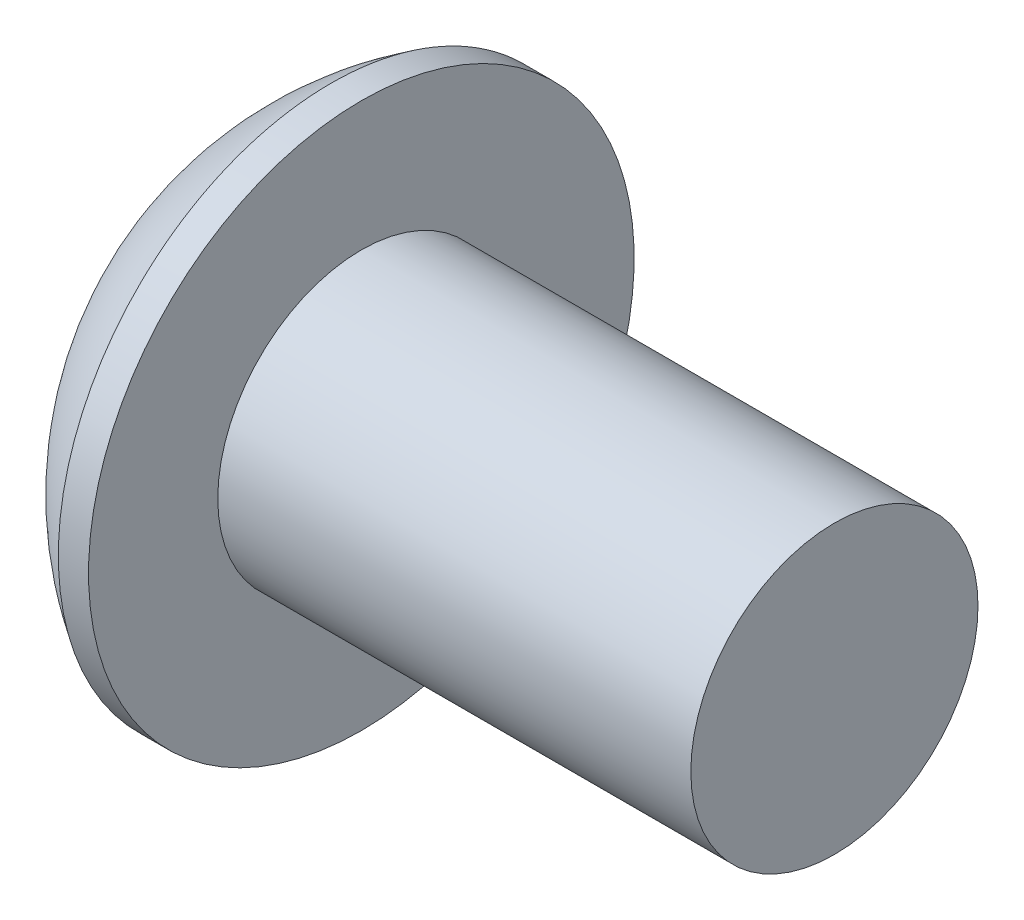
ISO-10303-21;
HEADER;
FILE_DESCRIPTION(('STEP AP214'),'2;1');
FILE_NAME('part.step','',(''),(''),'','','');
FILE_SCHEMA(('AUTOMOTIVE_DESIGN { 1 0 10303 214 1 1 1 1 }'));
ENDSEC;
DATA;
#1=APPLICATION_CONTEXT('core data for automotive mechanical design processes');
#2=APPLICATION_PROTOCOL_DEFINITION('international standard','automotive_design',2000,#1);
#3=PRODUCT_CONTEXT('',#1,'mechanical');
#4=PRODUCT('Part','Part','',(#3));
#5=PRODUCT_RELATED_PRODUCT_CATEGORY('part','',(#4));
#6=PRODUCT_DEFINITION_FORMATION('','',#4);
#7=PRODUCT_DEFINITION_CONTEXT('part definition',#1,'design');
#8=PRODUCT_DEFINITION('design','',#6,#7);
#9=PRODUCT_DEFINITION_SHAPE('','',#8);
#10=(LENGTH_UNIT() NAMED_UNIT(*) SI_UNIT(.MILLI.,.METRE.));
#11=(NAMED_UNIT(*) PLANE_ANGLE_UNIT() SI_UNIT($,.RADIAN.));
#12=(NAMED_UNIT(*) SI_UNIT($,.STERADIAN.) SOLID_ANGLE_UNIT());
#13=UNCERTAINTY_MEASURE_WITH_UNIT(LENGTH_MEASURE(1.E-05),#10,'distance_accuracy_value','');
#14=(GEOMETRIC_REPRESENTATION_CONTEXT(3) GLOBAL_UNCERTAINTY_ASSIGNED_CONTEXT((#13)) GLOBAL_UNIT_ASSIGNED_CONTEXT((#10,
#11,#12)) REPRESENTATION_CONTEXT('',''));
#15=CARTESIAN_POINT('',(0.,0.,0.));
#16=DIRECTION('',(0.,0.,1.));
#17=DIRECTION('',(1.,0.,0.));
#18=AXIS2_PLACEMENT_3D('',#15,#16,#17);
#19=CARTESIAN_POINT('',(-0.533400000000002,0.,0.));
#20=DIRECTION('',(-1.,0.,0.));
#21=DIRECTION('',(0.,0.,1.));
#22=AXIS2_PLACEMENT_3D('',#19,#20,#21);
#23=PLANE('',#22);
#24=DIRECTION('',(0.,0.5,0.866025403784439));
#25=VECTOR('',#24,1.);
#26=CARTESIAN_POINT('',(-0.533400000000002,1.83308710467706,0.));
#27=LINE('',#26,#25);
#28=CARTESIAN_POINT('',(-0.533400000000002,1.83308710467706,0.));
#29=VERTEX_POINT('',#28);
#30=CARTESIAN_POINT('',(-0.533400000000002,0.916543552338531,-1.5875));
#31=VERTEX_POINT('',#30);
#32=EDGE_CURVE('E114',#29,#31,#27,.F.);
#33=ORIENTED_EDGE('',*,*,#32,.T.);
#34=DIRECTION('',(0.,1.,0.));
#35=VECTOR('',#34,1.);
#36=CARTESIAN_POINT('',(-0.533400000000002,0.916543552338531,-1.5875));
#37=LINE('',#36,#35);
#38=CARTESIAN_POINT('',(-0.533400000000002,-0.916543552338531,-1.5875));
#39=VERTEX_POINT('',#38);
#40=EDGE_CURVE('E81',#31,#39,#37,.F.);
#41=ORIENTED_EDGE('',*,*,#40,.T.);
#42=DIRECTION('',(0.,0.5,-0.866025403784439));
#43=VECTOR('',#42,1.);
#44=CARTESIAN_POINT('',(-0.533400000000002,-0.916543552338531,-1.5875));
#45=LINE('',#44,#43);
#46=CARTESIAN_POINT('',(-0.533400000000002,-1.83308710467706,0.));
#47=VERTEX_POINT('',#46);
#48=EDGE_CURVE('E83',#39,#47,#45,.F.);
#49=ORIENTED_EDGE('',*,*,#48,.T.);
#50=DIRECTION('',(0.,-0.5,-0.866025403784439));
#51=VECTOR('',#50,1.);
#52=CARTESIAN_POINT('',(-0.533400000000002,-1.83308710467706,0.));
#53=LINE('',#52,#51);
#54=CARTESIAN_POINT('',(-0.533400000000002,-0.916543552338533,1.5875));
#55=VERTEX_POINT('',#54);
#56=EDGE_CURVE('E84',#47,#55,#53,.F.);
#57=ORIENTED_EDGE('',*,*,#56,.T.);
#58=DIRECTION('',(0.,-1.,0.));
#59=VECTOR('',#58,1.);
#60=CARTESIAN_POINT('',(-0.533400000000002,-0.916543552338532,1.5875));
#61=LINE('',#60,#59);
#62=CARTESIAN_POINT('',(-0.533400000000002,0.916543552338531,1.5875));
#63=VERTEX_POINT('',#62);
#64=EDGE_CURVE('E70',#55,#63,#61,.F.);
#65=ORIENTED_EDGE('',*,*,#64,.T.);
#66=DIRECTION('',(0.,-0.5,0.866025403784439));
#67=VECTOR('',#66,1.);
#68=CARTESIAN_POINT('',(-0.533400000000002,0.916543552338531,1.5875));
#69=LINE('',#68,#67);
#70=EDGE_CURVE('E109',#63,#29,#69,.F.);
#71=ORIENTED_EDGE('',*,*,#70,.T.);
#72=EDGE_LOOP('',(#33,#41,#49,#57,#65,#71));
#73=FACE_BOUND('',#72,.T.);
#74=ADVANCED_FACE('F16',(#73),#23,.T.);
#75=CARTESIAN_POINT('',(-0.533400000000002,-1.83308710467706,0.));
#76=DIRECTION('',(0.,-0.866025403784439,0.5));
#77=DIRECTION('',(0.,-0.5,-0.866025403784439));
#78=AXIS2_PLACEMENT_3D('',#75,#76,#77);
#79=PLANE('',#78);
#80=CARTESIAN_POINT('',(-2.56539999994394,-1.8330871046745,-2.00804498786736E-11));
#81=CARTESIAN_POINT('',(-2.53392818229741,-1.80158505518366,0.0545631502562923));
#82=CARTESIAN_POINT('',(-2.5043050627177,-1.76955629074211,0.110038597579172));
#83=CARTESIAN_POINT('',(-2.45006639539122,-1.70424635317817,0.223158727683824));
#84=CARTESIAN_POINT('',(-2.42548101615987,-1.6709589724711,0.280814162317604));
#85=CARTESIAN_POINT('',(-2.38336609605347,-1.60383660211837,0.397073518091736));
#86=CARTESIAN_POINT('',(-2.36573072948629,-1.57001869730198,0.455647847439699));
#87=CARTESIAN_POINT('',(-2.33856008862263,-1.50163859306838,0.574085662199493));
#88=CARTESIAN_POINT('',(-2.32900454007239,-1.46707848106388,0.633945532106421));
#89=CARTESIAN_POINT('',(-2.32038274183869,-1.40751253669323,0.737116774157155));
#90=CARTESIAN_POINT('',(-2.31910682172836,-1.38258360390154,0.780294952330845));
#91=CARTESIAN_POINT('',(-2.32125913780735,-1.33276652395073,0.866580665890379));
#92=CARTESIAN_POINT('',(-2.32468902284537,-1.30787839414808,0.90968817121394));
#93=CARTESIAN_POINT('',(-2.33605631415915,-1.25834345643267,0.995485200086784));
#94=CARTESIAN_POINT('',(-2.34399762019329,-1.23369687609494,1.03817432946455));
#95=CARTESIAN_POINT('',(-2.36395627681902,-1.18481740842653,1.12283605091316));
#96=CARTESIAN_POINT('',(-2.37597537628367,-1.16058470328902,1.16480832741616));
#97=CARTESIAN_POINT('',(-2.41164383187845,-1.09853862948576,1.27227527965358));
#98=CARTESIAN_POINT('',(-2.43797770752625,-1.06110942924036,1.33710455616529));
#99=CARTESIAN_POINT('',(-2.48243061452926,-1.00607390269188,1.43242888436855));
#100=CARTESIAN_POINT('',(-2.49804835924321,-0.987937988038022,1.46384120999077));
#101=CARTESIAN_POINT('',(-2.53070945051393,-0.951999508520197,1.52608848246242));
#102=CARTESIAN_POINT('',(-2.54775211871235,-0.934196789917587,1.55692369559499));
#103=CARTESIAN_POINT('',(-2.56539999993807,-0.916543552329633,1.58750000001541));
#104=B_SPLINE_CURVE_WITH_KNOTS('',3,(#80,#81,#82,#83,#84,#85,#86,#87,#88,#89,#90,#91,#92,#93,
#94,#95,#96,#97,#98,#99,#100,#101,#102,#103),.UNSPECIFIED.,.F.,.F.,(4,2,2,2,2,2,2,2,2,2,2,4),
(0.,0.211427927732169,0.424087197148228,0.633370156422424,0.842126401515785,0.991537201098734,
1.14100036552056,1.29059292577265,1.44024972414947,1.67781721417335,1.79627069411587,
1.91466809995991),.UNSPECIFIED.);
#105=CARTESIAN_POINT('',(-2.56539999993857,-1.83308710468646,0.));
#106=VERTEX_POINT('',#105);
#107=CARTESIAN_POINT('',(-2.56539999993106,-0.916543552342318,1.5875));
#108=VERTEX_POINT('',#107);
#109=EDGE_CURVE('E19',#106,#108,#104,.T.);
#110=ORIENTED_EDGE('',*,*,#109,.T.);
#111=DIRECTION('',(1.,0.,0.));
#112=VECTOR('',#111,1.);
#113=CARTESIAN_POINT('',(-0.533400000000002,-0.916543552338533,1.5875));
#114=LINE('',#113,#112);
#115=EDGE_CURVE('E89',#108,#55,#114,.T.);
#116=ORIENTED_EDGE('',*,*,#115,.T.);
#117=ORIENTED_EDGE('',*,*,#56,.F.);
#118=DIRECTION('',(1.,0.,0.));
#119=VECTOR('',#118,1.);
#120=CARTESIAN_POINT('',(-0.533400000000002,-1.83308710467706,0.));
#121=LINE('',#120,#119);
#122=EDGE_CURVE('E57',#47,#106,#121,.F.);
#123=ORIENTED_EDGE('',*,*,#122,.T.);
#124=EDGE_LOOP('',(#110,#116,#117,#123));
#125=FACE_BOUND('',#124,.T.);
#126=ADVANCED_FACE('F88',(#125),#79,.F.);
#127=CARTESIAN_POINT('',(-0.533400000000002,-0.916543552338531,-1.5875));
#128=DIRECTION('',(0.,-0.866025403784439,-0.5));
#129=DIRECTION('',(0.,0.5,-0.866025403784439));
#130=AXIS2_PLACEMENT_3D('',#127,#128,#129);
#131=PLANE('',#130);
#132=CARTESIAN_POINT('',(-2.56539999994527,-0.916543552319403,-1.58750000001409));
#133=CARTESIAN_POINT('',(-2.53392818229919,-0.948045601822691,-1.53293684974403));
#134=CARTESIAN_POINT('',(-2.50430506271949,-0.980074366269487,-1.47746140242354));
#135=CARTESIAN_POINT('',(-2.45006639539264,-1.04538430383757,-1.36434127232016));
#136=CARTESIAN_POINT('',(-2.42548101616093,-1.07867168454351,-1.30668583768523));
#137=CARTESIAN_POINT('',(-2.38336609605398,-1.14579405489574,-1.19042648190974));
#138=CARTESIAN_POINT('',(-2.36573072948662,-1.17961195971273,-1.13185215256154));
#139=CARTESIAN_POINT('',(-2.3385600886227,-1.2479920639471,-1.013414337801));
#140=CARTESIAN_POINT('',(-2.32900454007237,-1.28255217595175,-0.953554467893575));
#141=CARTESIAN_POINT('',(-2.32038274183866,-1.34211812032265,-0.850383225842316));
#142=CARTESIAN_POINT('',(-2.31910682172835,-1.36704705311438,-0.807205047668587));
#143=CARTESIAN_POINT('',(-2.32125913780739,-1.41686413306525,-0.720919334108961));
#144=CARTESIAN_POINT('',(-2.32468902284544,-1.44175226286793,-0.67781182878535));
#145=CARTESIAN_POINT('',(-2.33605631415929,-1.49128720058339,-0.592014799912417));
#146=CARTESIAN_POINT('',(-2.34399762019345,-1.51593378092113,-0.54932567053461));
#147=CARTESIAN_POINT('',(-2.36395627681926,-1.56481324858959,-0.464663949085931));
#148=CARTESIAN_POINT('',(-2.37597537628395,-1.58904595372712,-0.422691672582891));
#149=CARTESIAN_POINT('',(-2.41164383187876,-1.65109202753029,-0.315224720345625));
#150=CARTESIAN_POINT('',(-2.43797770752652,-1.6885212277756,-0.250395443834082));
#151=CARTESIAN_POINT('',(-2.48243061452944,-1.74355675432393,-0.15507111563107));
#152=CARTESIAN_POINT('',(-2.49804835924337,-1.76169266897775,-0.123658790008927));
#153=CARTESIAN_POINT('',(-2.53070945051401,-1.79763114849548,-0.0614115175374324));
#154=CARTESIAN_POINT('',(-2.5477521187124,-1.81543386709805,-0.0305763044049344));
#155=CARTESIAN_POINT('',(-2.56539999993807,-1.83308710468596,1.54136844652939E-11));
#156=B_SPLINE_CURVE_WITH_KNOTS('',3,(#132,#133,#134,#135,#136,#137,#138,#139,#140,#141,#142,
#143,#144,#145,#146,#147,#148,#149,#150,#151,#152,#153,#154,#155),.UNSPECIFIED.,.F.,.F.,(4,2,2,
2,2,2,2,2,2,2,2,4),(0.,0.211427927733669,0.424087197151313,0.633370156427101,0.842126401522016,
0.99153720110513,1.14100036552713,1.29059292577937,1.44024972415633,1.67781721417961,
1.79627069412184,1.9146680999656),.UNSPECIFIED.);
#157=CARTESIAN_POINT('',(-2.56539999995198,-0.916543552351339,-1.58750000002218));
#158=VERTEX_POINT('',#157);
#159=EDGE_CURVE('E93',#158,#106,#156,.T.);
#160=ORIENTED_EDGE('',*,*,#159,.T.);
#161=ORIENTED_EDGE('',*,*,#122,.F.);
#162=ORIENTED_EDGE('',*,*,#48,.F.);
#163=DIRECTION('',(-1.,0.,0.));
#164=VECTOR('',#163,1.);
#165=CARTESIAN_POINT('',(-0.533400000000002,-0.916543552338531,-1.5875));
#166=LINE('',#165,#164);
#167=EDGE_CURVE('E95',#39,#158,#166,.T.);
#168=ORIENTED_EDGE('',*,*,#167,.T.);
#169=EDGE_LOOP('',(#160,#161,#162,#168));
#170=FACE_BOUND('',#169,.T.);
#171=ADVANCED_FACE('F91',(#170),#131,.F.);
#172=CARTESIAN_POINT('',(-0.533400000000002,0.916543552338531,-1.5875));
#173=DIRECTION('',(0.,0.,-1.));
#174=DIRECTION('',(-1.,0.,0.));
#175=AXIS2_PLACEMENT_3D('',#172,#173,#174);
#176=PLANE('',#175);
#177=CARTESIAN_POINT('',(-2.56539999994527,0.916543552360294,-1.58749999999048));
#178=CARTESIAN_POINT('',(-2.53392818229821,0.853539453376781,-1.58749999999657));
#179=CARTESIAN_POINT('',(-2.50430506271702,0.789481924500113,-1.58749999999908));
#180=CARTESIAN_POINT('',(-2.45006639538581,0.658862049392287,-1.58750000000093));
#181=CARTESIAN_POINT('',(-2.42548101615122,0.59228728799181,-1.58750000000025));
#182=CARTESIAN_POINT('',(-2.38336609603683,0.458042547310979,-1.58749999999976));
#183=CARTESIAN_POINT('',(-2.36573072946494,0.390406737689213,-1.58749999999994));
#184=CARTESIAN_POINT('',(-2.3385600885904,0.253646529243895,-1.58750000000006));
#185=CARTESIAN_POINT('',(-2.32900454003397,0.184526305245804,-1.58750000000001));
#186=CARTESIAN_POINT('',(-2.32038274178942,0.0653944165301613,-1.58749999999999));
#187=CARTESIAN_POINT('',(-2.31910682167392,0.0155365509618711,-1.5875));
#188=CARTESIAN_POINT('',(-2.3212591377409,-0.0840976089101244,-1.5875));
#189=CARTESIAN_POINT('',(-2.32468902277208,-0.133873868500894,-1.5875));
#190=CARTESIAN_POINT('',(-2.33605631407098,-0.2329437439033,-1.5875));
#191=CARTESIAN_POINT('',(-2.34399762009707,-0.282236904564879,-1.5875));
#192=CARTESIAN_POINT('',(-2.36395627670599,-0.379995839874564,-1.5875));
#193=CARTESIAN_POINT('',(-2.37597537616188,-0.428461250136325,-1.5875));
#194=CARTESIAN_POINT('',(-2.41164383175616,-0.552553397787632,-1.5875));
#195=CARTESIAN_POINT('',(-2.43797770742117,-0.627411798334259,-1.5875));
#196=CARTESIAN_POINT('',(-2.48243061445881,-0.737482851511091,-1.5875));
#197=CARTESIAN_POINT('',(-2.49804835918582,-0.773754680844889,-1.5875));
#198=CARTESIAN_POINT('',(-2.53070945048496,-0.845631639931401,-1.5875));
#199=CARTESIAN_POINT('',(-2.54775211869874,-0.881237077161412,-1.5875));
#200=CARTESIAN_POINT('',(-2.56539999994071,-0.916543552361606,-1.5875));
#201=B_SPLINE_CURVE_WITH_KNOTS('',3,(#177,#178,#179,#180,#181,#182,#183,#184,#185,#186,#187,
#188,#189,#190,#191,#192,#193,#194,#195,#196,#197,#198,#199,#200),.UNSPECIFIED.,.F.,.F.,(4,2,2,
2,2,2,2,2,2,2,2,4),(0.,0.211427927701375,0.424087197086717,0.633370156331471,0.842126401395377,
0.991537200933545,1.14100036531054,1.29059292551773,1.44024972384963,1.677817214047,
1.79627069407681,1.91466810000777),.UNSPECIFIED.);
#202=CARTESIAN_POINT('',(-2.56539999995198,0.916543552337129,-1.58749999999757));
#203=VERTEX_POINT('',#202);
#204=EDGE_CURVE('E197',#203,#158,#201,.T.);
#205=ORIENTED_EDGE('',*,*,#204,.T.);
#206=ORIENTED_EDGE('',*,*,#167,.F.);
#207=ORIENTED_EDGE('',*,*,#40,.F.);
#208=DIRECTION('',(1.,0.,0.));
#209=VECTOR('',#208,1.);
#210=CARTESIAN_POINT('',(-0.533400000000002,0.916543552338531,-1.5875));
#211=LINE('',#210,#209);
#212=EDGE_CURVE('E111',#31,#203,#211,.F.);
#213=ORIENTED_EDGE('',*,*,#212,.T.);
#214=EDGE_LOOP('',(#205,#206,#207,#213));
#215=FACE_BOUND('',#214,.T.);
#216=ADVANCED_FACE('F187',(#215),#176,.F.);
#217=CARTESIAN_POINT('',(-0.533400000000002,1.83308710467706,0.));
#218=DIRECTION('',(0.,0.866025403784439,-0.5));
#219=DIRECTION('',(0.,0.5,0.866025403784439));
#220=AXIS2_PLACEMENT_3D('',#217,#218,#219);
#221=PLANE('',#220);
#222=CARTESIAN_POINT('',(-2.56539999994394,1.8330871046745,2.00800374309997E-11));
#223=CARTESIAN_POINT('',(-2.5339281822974,1.80158505518366,-0.0545631502562965));
#224=CARTESIAN_POINT('',(-2.5043050627177,1.76955629074211,-0.11003859757918));
#225=CARTESIAN_POINT('',(-2.45006639539121,1.70424635317816,-0.22315872768384));
#226=CARTESIAN_POINT('',(-2.42548101615987,1.67095897247109,-0.280814162317626));
#227=CARTESIAN_POINT('',(-2.38336609605347,1.60383660211835,-0.397073518091758));
#228=CARTESIAN_POINT('',(-2.36573072948628,1.57001869730197,-0.455647847439717));
#229=CARTESIAN_POINT('',(-2.33856008862263,1.50163859306837,-0.574085662199503));
#230=CARTESIAN_POINT('',(-2.32900454007239,1.46707848106388,-0.633945532106426));
#231=CARTESIAN_POINT('',(-2.32038274183869,1.40751253669322,-0.737116774157154));
#232=CARTESIAN_POINT('',(-2.31910682172836,1.38258360390154,-0.780294952330843));
#233=CARTESIAN_POINT('',(-2.32125913780735,1.33276652395073,-0.866580665890374));
#234=CARTESIAN_POINT('',(-2.32468902284537,1.30787839414808,-0.909688171213933));
#235=CARTESIAN_POINT('',(-2.33605631415915,1.25834345643267,-0.995485200086777));
#236=CARTESIAN_POINT('',(-2.34399762019328,1.23369687609495,-1.03817432946455));
#237=CARTESIAN_POINT('',(-2.36395627681902,1.18481740842653,-1.12283605091316));
#238=CARTESIAN_POINT('',(-2.37597537628367,1.16058470328902,-1.16480832741616));
#239=CARTESIAN_POINT('',(-2.41164383187872,1.09853862948529,-1.2722752796544));
#240=CARTESIAN_POINT('',(-2.43797770752691,1.06110942923942,-1.33710455616691));
#241=CARTESIAN_POINT('',(-2.48243061453059,1.00607390269029,-1.43242888437131));
#242=CARTESIAN_POINT('',(-2.49804835924479,0.987937988036214,-1.4638412099939));
#243=CARTESIAN_POINT('',(-2.53070945051602,0.951999508517968,-1.52608848246628));
#244=CARTESIAN_POINT('',(-2.54775211871471,0.934196789915152,-1.55692369559921));
#245=CARTESIAN_POINT('',(-2.56539999994071,0.916543552326994,-1.58750000001998));
#246=B_SPLINE_CURVE_WITH_KNOTS('',3,(#222,#223,#224,#225,#226,#227,#228,#229,#230,#231,#232,
#233,#234,#235,#236,#237,#238,#239,#240,#241,#242,#243,#244,#245),.UNSPECIFIED.,.F.,.F.,(4,2,2,
2,2,2,2,2,2,2,2,4),(0.,0.211427927732185,0.424087197148259,0.63337015642244,0.842126401515786,
0.99153720109873,1.14100036552055,1.29059292577265,1.44024972414947,1.67781721417631,
1.7962706941203,1.9146680999658),.UNSPECIFIED.);
#247=CARTESIAN_POINT('',(-2.56539999993857,1.83308710468646,0.));
#248=VERTEX_POINT('',#247);
#249=EDGE_CURVE('E191',#248,#203,#246,.T.);
#250=ORIENTED_EDGE('',*,*,#249,.T.);
#251=ORIENTED_EDGE('',*,*,#212,.F.);
#252=ORIENTED_EDGE('',*,*,#32,.F.);
#253=DIRECTION('',(1.,0.,0.));
#254=VECTOR('',#253,1.);
#255=CARTESIAN_POINT('',(-0.533400000000002,1.83308710467706,0.));
#256=LINE('',#255,#254);
#257=EDGE_CURVE('E106',#29,#248,#256,.F.);
#258=ORIENTED_EDGE('',*,*,#257,.T.);
#259=EDGE_LOOP('',(#250,#251,#252,#258));
#260=FACE_BOUND('',#259,.T.);
#261=ADVANCED_FACE('F183',(#260),#221,.F.);
#262=CARTESIAN_POINT('',(-0.533400000000002,0.916543552338531,1.5875));
#263=DIRECTION('',(0.,0.866025403784439,0.5));
#264=DIRECTION('',(0.,-0.5,0.866025403784439));
#265=AXIS2_PLACEMENT_3D('',#262,#263,#264);
#266=PLANE('',#265);
#267=CARTESIAN_POINT('',(-2.56539999994394,0.91654355231986,1.58750000000782));
#268=CARTESIAN_POINT('',(-2.53392818229741,0.948045601824288,1.5329368497393));
#269=CARTESIAN_POINT('',(-2.5043050627177,0.980074366271431,1.47746140241964));
#270=CARTESIAN_POINT('',(-2.45006639539122,1.04538430383949,1.36434127231737));
#271=CARTESIAN_POINT('',(-2.42548101615987,1.07867168454504,1.30668583768271));
#272=CARTESIAN_POINT('',(-2.38336609605347,1.14579405489669,1.19042648190795));
#273=CARTESIAN_POINT('',(-2.36573072948629,1.17961195971347,1.13185215256022));
#274=CARTESIAN_POINT('',(-2.33856008862263,1.24799206394736,1.01341433780059));
#275=CARTESIAN_POINT('',(-2.32900454007239,1.28255217595174,0.953554467893597));
#276=CARTESIAN_POINT('',(-2.32038274183869,1.34211812032234,0.850383225842832));
#277=CARTESIAN_POINT('',(-2.31910682172836,1.36704705311405,0.807205047669152));
#278=CARTESIAN_POINT('',(-2.32125913780735,1.41686413306487,0.720919334109624));
#279=CARTESIAN_POINT('',(-2.32468902284537,1.44175226286752,0.677811828786061));
#280=CARTESIAN_POINT('',(-2.33605631415915,1.49128720058292,0.592014799913215));
#281=CARTESIAN_POINT('',(-2.34399762019328,1.51593378092065,0.549325670535446));
#282=CARTESIAN_POINT('',(-2.36395627681902,1.56481324858906,0.464663949086841));
#283=CARTESIAN_POINT('',(-2.37597537628367,1.58904595372657,0.422691672583837));
#284=CARTESIAN_POINT('',(-2.41164383187845,1.65109202752983,0.315224720346425));
#285=CARTESIAN_POINT('',(-2.43797770752625,1.68852122777524,0.250395443834706));
#286=CARTESIAN_POINT('',(-2.48243061452926,1.74355675432371,0.155071115631445));
#287=CARTESIAN_POINT('',(-2.49804835924321,1.76169266897757,0.123658790009225));
#288=CARTESIAN_POINT('',(-2.53070945051393,1.7976311484954,0.0614115175375789));
#289=CARTESIAN_POINT('',(-2.54775211871235,1.81543386709801,0.0305763044050067));
#290=CARTESIAN_POINT('',(-2.56539999993807,1.83308710468596,-1.54142580803093E-11));
#291=B_SPLINE_CURVE_WITH_KNOTS('',3,(#267,#268,#269,#270,#271,#272,#273,#274,#275,#276,#277,
#278,#279,#280,#281,#282,#283,#284,#285,#286,#287,#288,#289,#290),.UNSPECIFIED.,.F.,.F.,(4,2,2,
2,2,2,2,2,2,2,2,4),(0.,0.211427927732169,0.424087197148227,0.633370156422423,0.842126401515785,
0.991537201098733,1.14100036552056,1.29059292577265,1.44024972414946,1.67781721417335,
1.79627069411587,1.91466809995991),.UNSPECIFIED.);
#292=CARTESIAN_POINT('',(-2.56539999993857,0.91654355234323,1.58750000000814));
#293=VERTEX_POINT('',#292);
#294=EDGE_CURVE('E165',#293,#248,#291,.T.);
#295=ORIENTED_EDGE('',*,*,#294,.T.);
#296=ORIENTED_EDGE('',*,*,#257,.F.);
#297=ORIENTED_EDGE('',*,*,#70,.F.);
#298=DIRECTION('',(1.,0.,0.));
#299=VECTOR('',#298,1.);
#300=CARTESIAN_POINT('',(-0.533400000000002,0.916543552338531,1.5875));
#301=LINE('',#300,#299);
#302=EDGE_CURVE('E38',#63,#293,#301,.F.);
#303=ORIENTED_EDGE('',*,*,#302,.T.);
#304=EDGE_LOOP('',(#295,#296,#297,#303));
#305=FACE_BOUND('',#304,.T.);
#306=ADVANCED_FACE('F176',(#305),#266,.F.);
#307=CARTESIAN_POINT('',(-0.533400000000002,-0.916543552338532,1.5875));
#308=DIRECTION('',(0.,0.,1.));
#309=DIRECTION('',(0.,-1.,0.));
#310=AXIS2_PLACEMENT_3D('',#307,#308,#309);
#311=PLANE('',#310);
#312=CARTESIAN_POINT('',(-2.56539999994394,-0.916543552354642,1.58749999998774));
#313=CARTESIAN_POINT('',(-2.53392818229741,-0.853539453359365,1.58749999999559));
#314=CARTESIAN_POINT('',(-2.50430506271771,-0.789481924470656,1.58749999999882));
#315=CARTESIAN_POINT('',(-2.45006639539122,-0.658862049338629,1.58750000000119));
#316=CARTESIAN_POINT('',(-2.42548101615988,-0.592287287925995,1.58750000000032));
#317=CARTESIAN_POINT('',(-2.38336609605349,-0.458042547221593,1.58749999999969));
#318=CARTESIAN_POINT('',(-2.36573072948631,-0.390406737588416,1.58749999999992));
#319=CARTESIAN_POINT('',(-2.33856008862266,-0.253646529120892,1.58750000000008));
#320=CARTESIAN_POINT('',(-2.32900454007243,-0.184526305112002,1.58750000000002));
#321=CARTESIAN_POINT('',(-2.32038274183874,-0.065394416370719,1.58749999999999));
#322=CARTESIAN_POINT('',(-2.31910682172841,-0.0155365507873145,1.5875));
#323=CARTESIAN_POINT('',(-2.32125913780742,0.0840976091143436,1.5875));
#324=CARTESIAN_POINT('',(-2.32468902284545,0.133873868719661,1.5875));
#325=CARTESIAN_POINT('',(-2.33605631415924,0.232943744150505,1.5875));
#326=CARTESIAN_POINT('',(-2.34399762019338,0.282236904825971,1.5875));
#327=CARTESIAN_POINT('',(-2.36395627681913,0.379995840162817,1.5875));
#328=CARTESIAN_POINT('',(-2.37597537628379,0.428461250437852,1.5875));
#329=CARTESIAN_POINT('',(-2.41164383187857,0.552553398044325,1.5875));
#330=CARTESIAN_POINT('',(-2.43797770752636,0.627411798535089,1.5875));
#331=CARTESIAN_POINT('',(-2.48243061452933,0.737482851631955,1.5875));
#332=CARTESIAN_POINT('',(-2.49804835924327,0.773754680939651,1.5875));
#333=CARTESIAN_POINT('',(-2.53070945051396,0.84563163997525,1.5875));
#334=CARTESIAN_POINT('',(-2.54775211871237,0.881237077180446,1.5875));
#335=CARTESIAN_POINT('',(-2.56539999993807,0.91654355235633,1.5875));
#336=B_SPLINE_CURVE_WITH_KNOTS('',3,(#312,#313,#314,#315,#316,#317,#318,#319,#320,#321,#322,
#323,#324,#325,#326,#327,#328,#329,#330,#331,#332,#333,#334,#335),.UNSPECIFIED.,.F.,.F.,(4,2,2,
2,2,2,2,2,2,2,2,4),(0.,0.211427927732202,0.424087197148294,0.633370156422521,0.842126401515914,
0.991537201098908,1.14100036552078,1.29059292577292,1.44024972414978,1.67781721417349,
1.79627069411592,1.91466809995988),.UNSPECIFIED.);
#337=EDGE_CURVE('E157',#108,#293,#336,.T.);
#338=ORIENTED_EDGE('',*,*,#337,.T.);
#339=ORIENTED_EDGE('',*,*,#302,.F.);
#340=ORIENTED_EDGE('',*,*,#64,.F.);
#341=ORIENTED_EDGE('',*,*,#115,.F.);
#342=EDGE_LOOP('',(#338,#339,#340,#341));
#343=FACE_BOUND('',#342,.T.);
#344=ADVANCED_FACE('F172',(#343),#311,.F.);
#345=CARTESIAN_POINT('',(-2.56540000003724,0.,0.));
#346=DIRECTION('',(-1.,0.,0.));
#347=DIRECTION('',(0.,-1.,0.));
#348=AXIS2_PLACEMENT_3D('',#345,#346,#347);
#349=CONICAL_SURFACE('',#348,1.83308710478514,0.78539816351237);
#350=ORIENTED_EDGE('',*,*,#109,.F.);
#351=CARTESIAN_POINT('',(-2.56539999992356,0.,0.));
#352=DIRECTION('',(-1.,0.,0.));
#353=DIRECTION('',(0.,-1.,0.));
#354=AXIS2_PLACEMENT_3D('',#351,#352,#353);
#355=CIRCLE('',#354,1.83308710467145);
#356=EDGE_CURVE('E164',#108,#106,#355,.F.);
#357=ORIENTED_EDGE('',*,*,#356,.F.);
#358=EDGE_LOOP('',(#350,#357));
#359=FACE_BOUND('',#358,.T.);
#360=ADVANCED_FACE('F175',(#359),#349,.F.);
#361=CARTESIAN_POINT('',(-2.56540000003724,0.,0.));
#362=DIRECTION('',(-1.,0.,0.));
#363=DIRECTION('',(0.,-1.,0.));
#364=AXIS2_PLACEMENT_3D('',#361,#362,#363);
#365=CONICAL_SURFACE('',#364,1.83308710478514,0.78539816351237);
#366=ORIENTED_EDGE('',*,*,#159,.F.);
#367=CARTESIAN_POINT('',(-2.56539999992356,0.,0.));
#368=DIRECTION('',(-1.,0.,0.));
#369=DIRECTION('',(0.,-1.,0.));
#370=AXIS2_PLACEMENT_3D('',#367,#368,#369);
#371=CIRCLE('',#370,1.83308710467145);
#372=EDGE_CURVE('E272',#106,#158,#371,.F.);
#373=ORIENTED_EDGE('',*,*,#372,.F.);
#374=EDGE_LOOP('',(#366,#373));
#375=FACE_BOUND('',#374,.T.);
#376=ADVANCED_FACE('F209',(#375),#365,.F.);
#377=CARTESIAN_POINT('',(-2.56540000003724,0.,0.));
#378=DIRECTION('',(-1.,0.,0.));
#379=DIRECTION('',(0.,-1.,0.));
#380=AXIS2_PLACEMENT_3D('',#377,#378,#379);
#381=CONICAL_SURFACE('',#380,1.83308710478514,0.785398163397448);
#382=ORIENTED_EDGE('',*,*,#204,.F.);
#383=CARTESIAN_POINT('',(-2.5653999999804,0.,0.));
#384=DIRECTION('',(-1.,0.,0.));
#385=DIRECTION('',(0.,-1.,0.));
#386=AXIS2_PLACEMENT_3D('',#383,#384,#385);
#387=CIRCLE('',#386,1.83308710472829);
#388=EDGE_CURVE('E269',#158,#203,#387,.F.);
#389=ORIENTED_EDGE('',*,*,#388,.F.);
#390=EDGE_LOOP('',(#382,#389));
#391=FACE_BOUND('',#390,.T.);
#392=ADVANCED_FACE('F205',(#391),#381,.F.);
#393=CARTESIAN_POINT('',(-2.56540000003724,0.,0.));
#394=DIRECTION('',(-1.,0.,0.));
#395=DIRECTION('',(0.,-1.,0.));
#396=AXIS2_PLACEMENT_3D('',#393,#394,#395);
#397=CONICAL_SURFACE('',#396,1.83308710478514,0.78539816351237);
#398=ORIENTED_EDGE('',*,*,#249,.F.);
#399=CARTESIAN_POINT('',(-2.56539999992356,0.,0.));
#400=DIRECTION('',(-1.,0.,0.));
#401=DIRECTION('',(0.,-1.,0.));
#402=AXIS2_PLACEMENT_3D('',#399,#400,#401);
#403=CIRCLE('',#402,1.83308710467145);
#404=EDGE_CURVE('E266',#203,#248,#403,.F.);
#405=ORIENTED_EDGE('',*,*,#404,.F.);
#406=EDGE_LOOP('',(#398,#405));
#407=FACE_BOUND('',#406,.T.);
#408=ADVANCED_FACE('F202',(#407),#397,.F.);
#409=CARTESIAN_POINT('',(-2.56540000003724,0.,0.));
#410=DIRECTION('',(-1.,0.,0.));
#411=DIRECTION('',(0.,-1.,0.));
#412=AXIS2_PLACEMENT_3D('',#409,#410,#411);
#413=CONICAL_SURFACE('',#412,1.83308710478514,0.78539816351237);
#414=ORIENTED_EDGE('',*,*,#294,.F.);
#415=CARTESIAN_POINT('',(-2.56539999992356,0.,0.));
#416=DIRECTION('',(-1.,0.,0.));
#417=DIRECTION('',(0.,-1.,0.));
#418=AXIS2_PLACEMENT_3D('',#415,#416,#417);
#419=CIRCLE('',#418,1.83308710467145);
#420=EDGE_CURVE('E261',#248,#293,#419,.F.);
#421=ORIENTED_EDGE('',*,*,#420,.F.);
#422=EDGE_LOOP('',(#414,#421));
#423=FACE_BOUND('',#422,.T.);
#424=ADVANCED_FACE('F152',(#423),#413,.F.);
#425=CARTESIAN_POINT('',(-2.56540000003724,0.,0.));
#426=DIRECTION('',(-1.,0.,0.));
#427=DIRECTION('',(0.,-1.,0.));
#428=AXIS2_PLACEMENT_3D('',#425,#426,#427);
#429=CONICAL_SURFACE('',#428,1.83308710478514,0.785398163512485);
#430=ORIENTED_EDGE('',*,*,#337,.F.);
#431=CARTESIAN_POINT('',(-2.56539999992356,0.,0.));
#432=DIRECTION('',(-1.,0.,0.));
#433=DIRECTION('',(0.,-1.,0.));
#434=AXIS2_PLACEMENT_3D('',#431,#432,#433);
#435=CIRCLE('',#434,1.83308710467145);
#436=EDGE_CURVE('E137',#293,#108,#435,.F.);
#437=ORIENTED_EDGE('',*,*,#436,.F.);
#438=EDGE_LOOP('',(#430,#437));
#439=FACE_BOUND('',#438,.T.);
#440=ADVANCED_FACE('F147',(#439),#429,.F.);
#441=CARTESIAN_POINT('',(-2.5654,0.,0.));
#442=DIRECTION('',(-1.,0.,0.));
#443=DIRECTION('',(0.,-1.,0.));
#444=AXIS2_PLACEMENT_3D('',#441,#442,#443);
#445=PLANE('',#444);
#446=CARTESIAN_POINT('',(-2.5654,-2.29235000000002,0.));
#447=CARTESIAN_POINT('',(-2.56540000000001,-2.29234961429958,-0.0643619991867162));
#448=CARTESIAN_POINT('',(-2.56540000000002,-2.28963695190109,-0.128735826629366));
#449=CARTESIAN_POINT('',(-2.56539999999999,-2.27880393843649,-0.257038618985287));
#450=CARTESIAN_POINT('',(-2.56539999999995,-2.27068199085128,-0.320967446929163));
#451=CARTESIAN_POINT('',(-2.56540000000006,-2.24906694794257,-0.448021254607718));
#452=CARTESIAN_POINT('',(-2.56540000000021,-2.23556532653462,-0.511144793381861));
#453=CARTESIAN_POINT('',(-2.56539999999979,-2.20328400495645,-0.636065176149322));
#454=CARTESIAN_POINT('',(-2.56539999999921,-2.18450002159115,-0.697860899533935));
#455=CARTESIAN_POINT('',(-2.56539999999869,-2.12048422735804,-0.88032980292775));
#456=CARTESIAN_POINT('',(-2.56539999999995,-2.0675359907946,-0.99839179592812));
#457=CARTESIAN_POINT('',(-2.56540000000006,-1.94254204858674,-1.22393765942148));
#458=CARTESIAN_POINT('',(-2.56539999999891,-1.87049561696644,-1.33142112758208));
#459=CARTESIAN_POINT('',(-2.56539999999932,-1.74974254194881,-1.48237719670935));
#460=CARTESIAN_POINT('',(-2.56539999999982,-1.70734573132302,-1.53101280076738));
#461=CARTESIAN_POINT('',(-2.56540000000018,-1.6186391029153,-1.62450601319185));
#462=CARTESIAN_POINT('',(-2.56540000000005,-1.57233309727313,-1.66936721890417));
#463=CARTESIAN_POINT('',(-2.56539999999995,-1.47608431707234,-1.7550488420402));
#464=CARTESIAN_POINT('',(-2.56539999999999,-1.42613990458995,-1.79586741981512));
#465=CARTESIAN_POINT('',(-2.56540000000002,-1.32299452541252,-1.87315615311523));
#466=CARTESIAN_POINT('',(-2.56540000000001,-1.26979280714188,-1.90962529930697));
#467=CARTESIAN_POINT('',(-2.56539999999999,-1.10588180153953,-2.0120772215109));
#468=CARTESIAN_POINT('',(-2.5654,-0.990764947001321,-2.07119486286667));
#469=CARTESIAN_POINT('',(-2.5654,-0.752302198839727,-2.16922858468856));
#470=CARTESIAN_POINT('',(-2.5654,-0.628956393121269,-2.2081448809145));
#471=CARTESIAN_POINT('',(-2.5654,-0.377466101733277,-2.2647275576592));
#472=CARTESIAN_POINT('',(-2.5654,-0.249321590440388,-2.28239382469379));
#473=CARTESIAN_POINT('',(-2.5654,0.0081143537161001,-2.29595665980956));
#474=CARTESIAN_POINT('',(-2.5654,0.137405786579698,-2.29185322789073));
#475=CARTESIAN_POINT('',(-2.5654,0.393449386933719,-2.2620096240906));
#476=CARTESIAN_POINT('',(-2.5654,0.520201567981077,-2.23626956775766));
#477=CARTESIAN_POINT('',(-2.5654,0.767645294384444,-2.16383549332687));
#478=CARTESIAN_POINT('',(-2.5654,0.888336774993549,-2.11714125142686));
#479=CARTESIAN_POINT('',(-2.5654,1.06210572146655,-2.03247976453654));
#480=CARTESIAN_POINT('',(-2.5654,1.11884498714066,-2.00180278323696));
#481=CARTESIAN_POINT('',(-2.5654,1.22954062855572,-1.93578011658036));
#482=CARTESIAN_POINT('',(-2.5654,1.28349764565392,-1.9004355139425));
#483=CARTESIAN_POINT('',(-2.5654,1.38821676641537,-1.82534174602348));
#484=CARTESIAN_POINT('',(-2.5654,1.43898030563028,-1.78559458231503));
#485=CARTESIAN_POINT('',(-2.5654,1.53701984534431,-1.70193996292362));
#486=CARTESIAN_POINT('',(-2.5654,1.5842924328055,-1.65802852924127));
#487=CARTESIAN_POINT('',(-2.5654,1.72023903553758,-1.52059650554139));
#488=CARTESIAN_POINT('',(-2.5654,1.80318066138239,-1.42127847626519));
#489=CARTESIAN_POINT('',(-2.5654,1.95118232345098,-1.21011519784664));
#490=CARTESIAN_POINT('',(-2.5654,2.01624303935584,-1.09827042509272));
#491=CARTESIAN_POINT('',(-2.5654,2.09907772661314,-0.923538238005839));
#492=CARTESIAN_POINT('',(-2.5654,2.12425103063558,-0.864058373981966));
#493=CARTESIAN_POINT('',(-2.5654,2.16947990046565,-0.743221562175601));
#494=CARTESIAN_POINT('',(-2.5654,2.18953960800684,-0.681866178863365));
#495=CARTESIAN_POINT('',(-2.5654,2.22438542051156,-0.557786972400356));
#496=CARTESIAN_POINT('',(-2.5654,2.23917985294818,-0.495065478128172));
#497=CARTESIAN_POINT('',(-2.5654,2.26343456384453,-0.368611258323514));
#498=CARTESIAN_POINT('',(-2.5654,2.27289641559285,-0.304878836759566));
#499=CARTESIAN_POINT('',(-2.5654,2.28388649696736,-0.200873029360621));
#500=CARTESIAN_POINT('',(-2.5654,2.28705930623293,-0.160766164180096));
#501=CARTESIAN_POINT('',(-2.5654,2.29129117827044,-0.0804410725432706));
#502=CARTESIAN_POINT('',(-2.5654,2.29235024104238,-0.0402228460869715));
#503=CARTESIAN_POINT('',(-2.56540000000001,2.29234961429956,0.0643619991867166));
#504=CARTESIAN_POINT('',(-2.56540000000002,2.28963695190107,0.128735826629366));
#505=CARTESIAN_POINT('',(-2.56539999999999,2.27880393843648,0.257038618985288));
#506=CARTESIAN_POINT('',(-2.56539999999995,2.27068199085126,0.320967446929163));
#507=CARTESIAN_POINT('',(-2.56540000000006,2.24906694794255,0.448021254607719));
#508=CARTESIAN_POINT('',(-2.56540000000021,2.2355653265346,0.511144793381862));
#509=CARTESIAN_POINT('',(-2.56539999999979,2.20328400495644,0.636065176149322));
#510=CARTESIAN_POINT('',(-2.56539999999921,2.18450002159113,0.697860899533936));
#511=CARTESIAN_POINT('',(-2.56539999999869,2.12048422735802,0.88032980292775));
#512=CARTESIAN_POINT('',(-2.56539999999995,2.06753599079459,0.998391795928119));
#513=CARTESIAN_POINT('',(-2.56540000000006,1.94254204858672,1.22393765942147));
#514=CARTESIAN_POINT('',(-2.56539999999891,1.87049561696642,1.33142112758208));
#515=CARTESIAN_POINT('',(-2.56539999999933,1.7497425419488,1.48237719670935));
#516=CARTESIAN_POINT('',(-2.56539999999982,1.707345731323,1.53101280076738));
#517=CARTESIAN_POINT('',(-2.56540000000018,1.61863910291529,1.62450601319185));
#518=CARTESIAN_POINT('',(-2.56540000000005,1.57233309727312,1.66936721890418));
#519=CARTESIAN_POINT('',(-2.56539999999995,1.47608431707233,1.75504884204021));
#520=CARTESIAN_POINT('',(-2.56539999999999,1.42613990458993,1.79586741981512));
#521=CARTESIAN_POINT('',(-2.56540000000002,1.3229945254125,1.87315615311523));
#522=CARTESIAN_POINT('',(-2.56540000000001,1.26979280714187,1.90962529930697));
#523=CARTESIAN_POINT('',(-2.56539999999999,1.10588180153952,2.0120772215109));
#524=CARTESIAN_POINT('',(-2.5654,0.990764947001304,2.07119486286667));
#525=CARTESIAN_POINT('',(-2.5654,0.75230219883971,2.16922858468856));
#526=CARTESIAN_POINT('',(-2.5654,0.628956393121252,2.2081448809145));
#527=CARTESIAN_POINT('',(-2.5654,0.377466101733262,2.2647275576592));
#528=CARTESIAN_POINT('',(-2.5654,0.249321590440372,2.28239382469379));
#529=CARTESIAN_POINT('',(-2.5654,-0.00811435371611611,2.29595665980955));
#530=CARTESIAN_POINT('',(-2.5654,-0.137405786579714,2.29185322789072));
#531=CARTESIAN_POINT('',(-2.5654,-0.393449386933735,2.2620096240906));
#532=CARTESIAN_POINT('',(-2.5654,-0.520201567981094,2.23626956775766));
#533=CARTESIAN_POINT('',(-2.5654,-0.767645294384462,2.16383549332688));
#534=CARTESIAN_POINT('',(-2.5654,-0.888336774993567,2.11714125142686));
#535=CARTESIAN_POINT('',(-2.5654,-1.06210572146657,2.03247976453654));
#536=CARTESIAN_POINT('',(-2.5654,-1.11884498714068,2.00180278323695));
#537=CARTESIAN_POINT('',(-2.5654,-1.22954062855574,1.93578011658036));
#538=CARTESIAN_POINT('',(-2.5654,-1.28349764565394,1.9004355139425));
#539=CARTESIAN_POINT('',(-2.5654,-1.38821676641539,1.82534174602348));
#540=CARTESIAN_POINT('',(-2.5654,-1.4389803056303,1.78559458231503));
#541=CARTESIAN_POINT('',(-2.5654,-1.53701984534432,1.70193996292362));
#542=CARTESIAN_POINT('',(-2.5654,-1.58429243280552,1.65802852924127));
#543=CARTESIAN_POINT('',(-2.5654,-1.7202390355376,1.52059650554139));
#544=CARTESIAN_POINT('',(-2.5654,-1.8031806613824,1.42127847626519));
#545=CARTESIAN_POINT('',(-2.5654,-1.951182323451,1.21011519784664));
#546=CARTESIAN_POINT('',(-2.5654,-2.01624303935586,1.09827042509272));
#547=CARTESIAN_POINT('',(-2.5654,-2.09907772661316,0.923538238005837));
#548=CARTESIAN_POINT('',(-2.5654,-2.1242510306356,0.864058373981964));
#549=CARTESIAN_POINT('',(-2.5654,-2.16947990046567,0.743221562175599));
#550=CARTESIAN_POINT('',(-2.5654,-2.18953960800686,0.681866178863365));
#551=CARTESIAN_POINT('',(-2.5654,-2.22438542051158,0.557786972400357));
#552=CARTESIAN_POINT('',(-2.5654,-2.2391798529482,0.495065478128172));
#553=CARTESIAN_POINT('',(-2.5654,-2.26343456384455,0.368611258323514));
#554=CARTESIAN_POINT('',(-2.5654,-2.27289641559287,0.304878836759567));
#555=CARTESIAN_POINT('',(-2.5654,-2.28388649696738,0.200873029360623));
#556=CARTESIAN_POINT('',(-2.5654,-2.28705930623295,0.160766164180096));
#557=CARTESIAN_POINT('',(-2.5654,-2.29129117827046,0.080441072543271));
#558=CARTESIAN_POINT('',(-2.5654,-2.29235024104239,0.0402228460869719));
#559=CARTESIAN_POINT('',(-2.5654,-2.29235000000002,0.));
#560=B_SPLINE_CURVE_WITH_KNOTS('',3,(#446,#447,#448,#449,#450,#451,#452,#453,#454,#455,#456,
#457,#458,#459,#460,#461,#462,#463,#464,#465,#466,#467,#468,#469,#470,#471,#472,#473,#474,#475,
#476,#477,#478,#479,#480,#481,#482,#483,#484,#485,#486,#487,#488,#489,#490,#491,#492,#493,#494,
#495,#496,#497,#498,#499,#500,#501,#502,#503,#504,#505,#506,#507,#508,#509,#510,#511,#512,#513,
#514,#515,#516,#517,#518,#519,#520,#521,#522,#523,#524,#525,#526,#527,#528,#529,#530,#531,#532,
#533,#534,#535,#536,#537,#538,#539,#540,#541,#542,#543,#544,#545,#546,#547,#548,#549,#550,#551,
#552,#553,#554,#555,#556,#557,#558,#559),.UNSPECIFIED.,.T.,.F.,(4,2,2,2,2,2,2,2,2,2,2,2,2,2,2,2,
2,2,2,2,2,2,2,2,2,2,2,2,2,2,2,2,2,2,2,2,2,2,2,2,2,2,2,2,2,2,2,2,2,2,2,2,2,2,2,2,4),(0.,
0.193048968618034,0.386154939782395,0.579568183995959,0.77313871149104,1.15935703864578,
1.54559004914645,1.73895960916369,1.93214273180064,2.12541336477222,2.31872876140889,
2.70495649282619,3.09118009906583,3.47740576789432,3.86363143672286,4.24985504296255,
4.6360827743798,4.82939817101621,5.02266880398749,5.21585192662421,5.40922148664123,
5.79545449714218,6.18167282429725,6.37524335179263,6.56865659600643,6.7617625671709,
6.9548115357891,7.07545693291923,7.19610233004938,7.38915129866742,7.58225726983178,
7.77567051404534,7.96924104154042,8.35545936869516,8.74169237919583,8.93506193921307,
9.12824506185002,9.3215156948216,9.51483109145827,9.90105882287557,10.2872824291152,
10.6735080979437,11.0597337667722,11.4459573730119,11.8321851044292,12.0255005010656,
12.2187711340369,12.4119542566736,12.6053238166906,12.9915568271916,13.3777751543466,
13.571345681842,13.7647589260558,13.9578648972203,14.1509138658385,14.2715592629686,
14.3922046600988),.UNSPECIFIED.);
#561=CARTESIAN_POINT('',(-2.5654,-2.29235000000002,0.));
#562=VERTEX_POINT('',#561);
#563=EDGE_CURVE('E130',#562,#562,#560,.T.);
#564=ORIENTED_EDGE('',*,*,#563,.F.);
#565=EDGE_LOOP('',(#564));
#566=FACE_BOUND('',#565,.T.);
#567=ORIENTED_EDGE('',*,*,#420,.T.);
#568=ORIENTED_EDGE('',*,*,#436,.T.);
#569=ORIENTED_EDGE('',*,*,#356,.T.);
#570=ORIENTED_EDGE('',*,*,#372,.T.);
#571=ORIENTED_EDGE('',*,*,#388,.T.);
#572=ORIENTED_EDGE('',*,*,#404,.T.);
#573=EDGE_LOOP('',(#567,#568,#569,#570,#571,#572));
#574=FACE_BOUND('',#573,.T.);
#575=ADVANCED_FACE('F143',(#566,#574),#445,.T.);
#576=CARTESIAN_POINT('',(2.29449606481481,0.,0.));
#577=DIRECTION('',(0.,1.,0.));
#578=DIRECTION('',(-1.,0.,0.));
#579=AXIS2_PLACEMENT_3D('',#576,#577,#578);
#580=SPHERICAL_SURFACE('',#579,5.37340285883187);
#581=ORIENTED_EDGE('',*,*,#563,.T.);
#582=EDGE_LOOP('',(#581));
#583=FACE_BOUND('',#582,.T.);
#584=CARTESIAN_POINT('',(-0.508,0.,0.));
#585=DIRECTION('',(1.,0.,0.));
#586=DIRECTION('',(0.,1.,0.));
#587=AXIS2_PLACEMENT_3D('',#584,#585,#586);
#588=CIRCLE('',#587,4.5847);
#589=CARTESIAN_POINT('',(-0.508,4.5847,0.));
#590=VERTEX_POINT('',#589);
#591=EDGE_CURVE('E127',#590,#590,#588,.T.);
#592=ORIENTED_EDGE('',*,*,#591,.F.);
#593=EDGE_LOOP('',(#592));
#594=FACE_BOUND('',#593,.T.);
#595=ADVANCED_FACE('F139',(#583,#594),#580,.T.);
#596=CARTESIAN_POINT('',(0.,0.,0.));
#597=DIRECTION('',(1.,0.,0.));
#598=DIRECTION('',(0.,1.,0.));
#599=AXIS2_PLACEMENT_3D('',#596,#597,#598);
#600=CYLINDRICAL_SURFACE('',#599,4.5847);
#601=ORIENTED_EDGE('',*,*,#591,.T.);
#602=EDGE_LOOP('',(#601));
#603=FACE_BOUND('',#602,.T.);
#604=CARTESIAN_POINT('',(0.,0.,0.));
#605=DIRECTION('',(1.,0.,0.));
#606=DIRECTION('',(0.,1.,0.));
#607=AXIS2_PLACEMENT_3D('',#604,#605,#606);
#608=CIRCLE('',#607,4.5847);
#609=CARTESIAN_POINT('',(0.,4.5847,0.));
#610=VERTEX_POINT('',#609);
#611=EDGE_CURVE('E124',#610,#610,#608,.T.);
#612=ORIENTED_EDGE('',*,*,#611,.F.);
#613=EDGE_LOOP('',(#612));
#614=FACE_BOUND('',#613,.T.);
#615=ADVANCED_FACE('F240',(#603,#614),#600,.T.);
#616=CARTESIAN_POINT('',(7.9502,0.,0.));
#617=DIRECTION('',(1.,0.,0.));
#618=DIRECTION('',(0.,1.,0.));
#619=AXIS2_PLACEMENT_3D('',#616,#617,#618);
#620=PLANE('',#619);
#621=CARTESIAN_POINT('',(7.9502,0.,0.));
#622=DIRECTION('',(-1.,0.,0.));
#623=DIRECTION('',(0.,-1.,0.));
#624=AXIS2_PLACEMENT_3D('',#621,#622,#623);
#625=CIRCLE('',#624,2.413);
#626=CARTESIAN_POINT('',(7.9502,-2.413,0.));
#627=VERTEX_POINT('',#626);
#628=EDGE_CURVE('E29',#627,#627,#625,.T.);
#629=ORIENTED_EDGE('',*,*,#628,.F.);
#630=EDGE_LOOP('',(#629));
#631=FACE_BOUND('',#630,.T.);
#632=ADVANCED_FACE('F234',(#631),#620,.T.);
#633=CARTESIAN_POINT('',(0.,4.5847,0.));
#634=DIRECTION('',(1.,0.,0.));
#635=DIRECTION('',(0.,1.,0.));
#636=AXIS2_PLACEMENT_3D('',#633,#634,#635);
#637=PLANE('',#636);
#638=CARTESIAN_POINT('',(0.,0.,0.));
#639=DIRECTION('',(-1.,0.,0.));
#640=DIRECTION('',(0.,-1.,0.));
#641=AXIS2_PLACEMENT_3D('',#638,#639,#640);
#642=CIRCLE('',#641,2.413);
#643=CARTESIAN_POINT('',(0.,-2.413,0.));
#644=VERTEX_POINT('',#643);
#645=EDGE_CURVE('E11',#644,#644,#642,.F.);
#646=ORIENTED_EDGE('',*,*,#645,.F.);
#647=EDGE_LOOP('',(#646));
#648=FACE_BOUND('',#647,.T.);
#649=ORIENTED_EDGE('',*,*,#611,.T.);
#650=EDGE_LOOP('',(#649));
#651=FACE_BOUND('',#650,.T.);
#652=ADVANCED_FACE('F228',(#648,#651),#637,.T.);
#653=CARTESIAN_POINT('',(7.9502,0.,0.));
#654=DIRECTION('',(-1.,0.,0.));
#655=DIRECTION('',(0.,-1.,0.));
#656=AXIS2_PLACEMENT_3D('',#653,#654,#655);
#657=CYLINDRICAL_SURFACE('',#656,2.413);
#658=ORIENTED_EDGE('',*,*,#628,.T.);
#659=EDGE_LOOP('',(#658));
#660=FACE_BOUND('',#659,.T.);
#661=ORIENTED_EDGE('',*,*,#645,.T.);
#662=EDGE_LOOP('',(#661));
#663=FACE_BOUND('',#662,.T.);
#664=ADVANCED_FACE('F226',(#660,#663),#657,.T.);
#665=CLOSED_SHELL('',(#74,#126,#171,#216,#261,#306,#344,#360,#376,#392,#408,#424,#440,#575,#595,
#615,#632,#652,#664));
#666=MANIFOLD_SOLID_BREP('B1',#665);
#667=ADVANCED_BREP_SHAPE_REPRESENTATION('',(#18,#666),#14);
#668=SHAPE_DEFINITION_REPRESENTATION(#9,#667);
ENDSEC;
END-ISO-10303-21;
